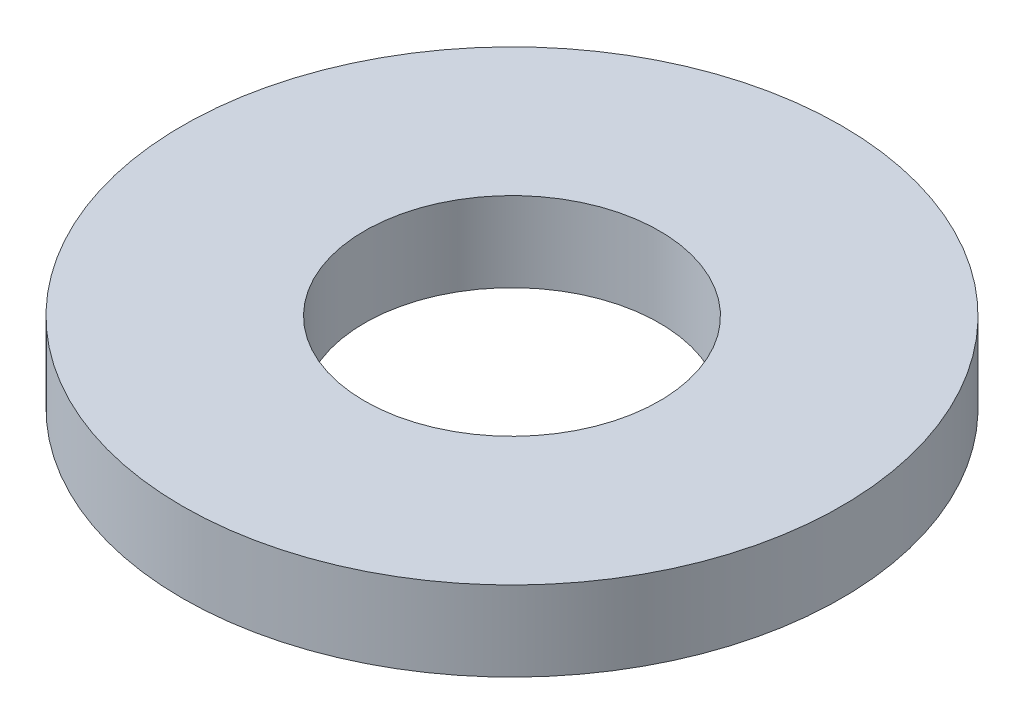
ISO-10303-21;
HEADER;
FILE_DESCRIPTION(('STEP AP214'),'2;1');
FILE_NAME('part.step','',(''),(''),'','','');
FILE_SCHEMA(('AUTOMOTIVE_DESIGN { 1 0 10303 214 1 1 1 1 }'));
ENDSEC;
DATA;
#1=APPLICATION_CONTEXT('core data for automotive mechanical design processes');
#2=APPLICATION_PROTOCOL_DEFINITION('international standard','automotive_design',2000,#1);
#3=PRODUCT_CONTEXT('',#1,'mechanical');
#4=PRODUCT('Part','Part','',(#3));
#5=PRODUCT_RELATED_PRODUCT_CATEGORY('part','',(#4));
#6=PRODUCT_DEFINITION_FORMATION('','',#4);
#7=PRODUCT_DEFINITION_CONTEXT('part definition',#1,'design');
#8=PRODUCT_DEFINITION('design','',#6,#7);
#9=PRODUCT_DEFINITION_SHAPE('','',#8);
#10=(LENGTH_UNIT() NAMED_UNIT(*) SI_UNIT(.MILLI.,.METRE.));
#11=(NAMED_UNIT(*) PLANE_ANGLE_UNIT() SI_UNIT($,.RADIAN.));
#12=(NAMED_UNIT(*) SI_UNIT($,.STERADIAN.) SOLID_ANGLE_UNIT());
#13=UNCERTAINTY_MEASURE_WITH_UNIT(LENGTH_MEASURE(1.E-05),#10,'distance_accuracy_value','');
#14=(GEOMETRIC_REPRESENTATION_CONTEXT(3) GLOBAL_UNCERTAINTY_ASSIGNED_CONTEXT((#13)) GLOBAL_UNIT_ASSIGNED_CONTEXT((#10,
#11,#12)) REPRESENTATION_CONTEXT('',''));
#15=CARTESIAN_POINT('',(0.,0.,0.));
#16=DIRECTION('',(0.,0.,1.));
#17=DIRECTION('',(1.,0.,0.));
#18=AXIS2_PLACEMENT_3D('',#15,#16,#17);
#19=CARTESIAN_POINT('',(0.,23.,0.));
#20=DIRECTION('',(0.,-1.,0.));
#21=DIRECTION('',(0.,0.,-1.));
#22=AXIS2_PLACEMENT_3D('',#19,#20,#21);
#23=CYLINDRICAL_SURFACE('',#22,95.);
#24=CARTESIAN_POINT('',(0.,23.,0.));
#25=DIRECTION('',(0.,1.,0.));
#26=DIRECTION('',(0.,0.,1.));
#27=AXIS2_PLACEMENT_3D('',#24,#25,#26);
#28=CIRCLE('',#27,95.);
#29=CARTESIAN_POINT('',(0.,23.,95.));
#30=VERTEX_POINT('',#29);
#31=EDGE_CURVE('E10',#30,#30,#28,.T.);
#32=ORIENTED_EDGE('',*,*,#31,.F.);
#33=EDGE_LOOP('',(#32));
#34=FACE_BOUND('',#33,.T.);
#35=CARTESIAN_POINT('',(0.,0.,0.));
#36=DIRECTION('',(0.,1.,0.));
#37=DIRECTION('',(0.,0.,1.));
#38=AXIS2_PLACEMENT_3D('',#35,#36,#37);
#39=CIRCLE('',#38,95.);
#40=CARTESIAN_POINT('',(0.,0.,95.));
#41=VERTEX_POINT('',#40);
#42=EDGE_CURVE('E37',#41,#41,#39,.T.);
#43=ORIENTED_EDGE('',*,*,#42,.T.);
#44=EDGE_LOOP('',(#43));
#45=FACE_BOUND('',#44,.T.);
#46=ADVANCED_FACE('F40',(#34,#45),#23,.T.);
#47=CARTESIAN_POINT('',(0.,23.,0.));
#48=DIRECTION('',(0.,1.,0.));
#49=DIRECTION('',(0.,0.,1.));
#50=AXIS2_PLACEMENT_3D('',#47,#48,#49);
#51=PLANE('',#50);
#52=CARTESIAN_POINT('',(0.,23.,0.));
#53=DIRECTION('',(0.,1.,0.));
#54=DIRECTION('',(0.,0.,1.));
#55=AXIS2_PLACEMENT_3D('',#52,#53,#54);
#56=CIRCLE('',#55,42.5);
#57=CARTESIAN_POINT('',(0.,23.,42.5));
#58=VERTEX_POINT('',#57);
#59=EDGE_CURVE('E50',#58,#58,#56,.T.);
#60=ORIENTED_EDGE('',*,*,#59,.F.);
#61=EDGE_LOOP('',(#60));
#62=FACE_BOUND('',#61,.T.);
#63=ORIENTED_EDGE('',*,*,#31,.T.);
#64=EDGE_LOOP('',(#63));
#65=FACE_BOUND('',#64,.T.);
#66=ADVANCED_FACE('F59',(#62,#65),#51,.T.);
#67=CARTESIAN_POINT('',(0.,0.,0.));
#68=DIRECTION('',(0.,1.,0.));
#69=DIRECTION('',(0.,0.,1.));
#70=AXIS2_PLACEMENT_3D('',#67,#68,#69);
#71=PLANE('',#70);
#72=CARTESIAN_POINT('',(0.,0.,0.));
#73=DIRECTION('',(0.,1.,0.));
#74=DIRECTION('',(0.,0.,1.));
#75=AXIS2_PLACEMENT_3D('',#72,#73,#74);
#76=CIRCLE('',#75,42.5);
#77=CARTESIAN_POINT('',(0.,0.,42.5));
#78=VERTEX_POINT('',#77);
#79=EDGE_CURVE('E47',#78,#78,#76,.T.);
#80=ORIENTED_EDGE('',*,*,#79,.T.);
#81=EDGE_LOOP('',(#80));
#82=FACE_BOUND('',#81,.T.);
#83=ORIENTED_EDGE('',*,*,#42,.F.);
#84=EDGE_LOOP('',(#83));
#85=FACE_BOUND('',#84,.T.);
#86=ADVANCED_FACE('F58',(#82,#85),#71,.F.);
#87=CARTESIAN_POINT('',(0.,23.,0.));
#88=DIRECTION('',(0.,-1.,0.));
#89=DIRECTION('',(0.,0.,-1.));
#90=AXIS2_PLACEMENT_3D('',#87,#88,#89);
#91=CYLINDRICAL_SURFACE('',#90,42.5);
#92=ORIENTED_EDGE('',*,*,#59,.T.);
#93=EDGE_LOOP('',(#92));
#94=FACE_BOUND('',#93,.T.);
#95=ORIENTED_EDGE('',*,*,#79,.F.);
#96=EDGE_LOOP('',(#95));
#97=FACE_BOUND('',#96,.T.);
#98=ADVANCED_FACE('F54',(#94,#97),#91,.F.);
#99=CLOSED_SHELL('',(#46,#66,#86,#98));
#100=MANIFOLD_SOLID_BREP('B2',#99);
#101=ADVANCED_BREP_SHAPE_REPRESENTATION('',(#18,#100),#14);
#102=SHAPE_DEFINITION_REPRESENTATION(#9,#101);
ENDSEC;
END-ISO-10303-21;
